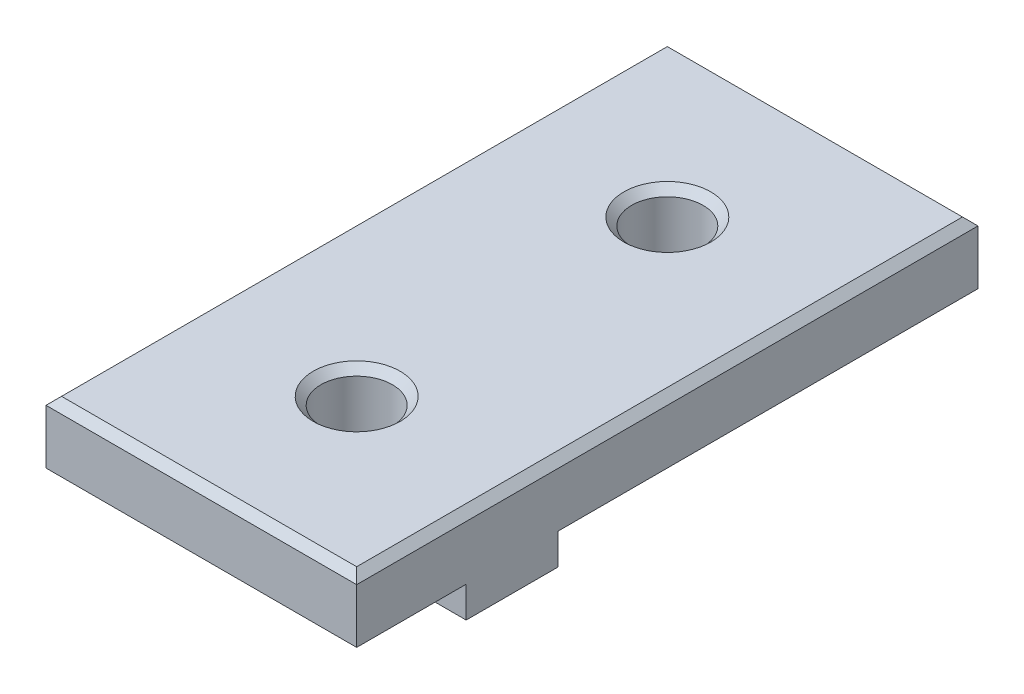
ISO-10303-21;
HEADER;
FILE_DESCRIPTION(('STEP AP214'),'2;1');
FILE_NAME('part.step','',(''),(''),'','','');
FILE_SCHEMA(('AUTOMOTIVE_DESIGN { 1 0 10303 214 1 1 1 1 }'));
ENDSEC;
DATA;
#1=APPLICATION_CONTEXT('core data for automotive mechanical design processes');
#2=APPLICATION_PROTOCOL_DEFINITION('international standard','automotive_design',2000,#1);
#3=PRODUCT_CONTEXT('',#1,'mechanical');
#4=PRODUCT('Part','Part','',(#3));
#5=PRODUCT_RELATED_PRODUCT_CATEGORY('part','',(#4));
#6=PRODUCT_DEFINITION_FORMATION('','',#4);
#7=PRODUCT_DEFINITION_CONTEXT('part definition',#1,'design');
#8=PRODUCT_DEFINITION('design','',#6,#7);
#9=PRODUCT_DEFINITION_SHAPE('','',#8);
#10=(LENGTH_UNIT() NAMED_UNIT(*) SI_UNIT(.MILLI.,.METRE.));
#11=(NAMED_UNIT(*) PLANE_ANGLE_UNIT() SI_UNIT($,.RADIAN.));
#12=(NAMED_UNIT(*) SI_UNIT($,.STERADIAN.) SOLID_ANGLE_UNIT());
#13=UNCERTAINTY_MEASURE_WITH_UNIT(LENGTH_MEASURE(1.E-05),#10,'distance_accuracy_value','');
#14=(GEOMETRIC_REPRESENTATION_CONTEXT(3) GLOBAL_UNCERTAINTY_ASSIGNED_CONTEXT((#13)) GLOBAL_UNIT_ASSIGNED_CONTEXT((#10,
#11,#12)) REPRESENTATION_CONTEXT('',''));
#15=CARTESIAN_POINT('',(0.,0.,0.));
#16=DIRECTION('',(0.,0.,1.));
#17=DIRECTION('',(1.,0.,0.));
#18=AXIS2_PLACEMENT_3D('',#15,#16,#17);
#19=CARTESIAN_POINT('',(0.,0.,0.));
#20=DIRECTION('',(0.,1.,0.));
#21=DIRECTION('',(0.,0.,1.));
#22=AXIS2_PLACEMENT_3D('',#19,#20,#21);
#23=PLANE('',#22);
#24=DIRECTION('',(0.,0.,1.));
#25=VECTOR('',#24,1.);
#26=CARTESIAN_POINT('',(2.95,0.,-7.));
#27=LINE('',#26,#25);
#28=CARTESIAN_POINT('',(2.95,0.,-7.));
#29=VERTEX_POINT('',#28);
#30=CARTESIAN_POINT('',(2.95,0.,-1.));
#31=VERTEX_POINT('',#30);
#32=EDGE_CURVE('E267',#29,#31,#27,.T.);
#33=ORIENTED_EDGE('',*,*,#32,.F.);
#34=DIRECTION('',(1.,0.,0.));
#35=VECTOR('',#34,1.);
#36=CARTESIAN_POINT('',(-2.95,0.,-7.));
#37=LINE('',#36,#35);
#38=CARTESIAN_POINT('',(-2.95,0.,-7.));
#39=VERTEX_POINT('',#38);
#40=EDGE_CURVE('E272',#39,#29,#37,.T.);
#41=ORIENTED_EDGE('',*,*,#40,.F.);
#42=DIRECTION('',(0.,0.,-1.));
#43=VECTOR('',#42,1.);
#44=CARTESIAN_POINT('',(-2.95,0.,-7.));
#45=LINE('',#44,#43);
#46=CARTESIAN_POINT('',(-2.95,0.,-1.));
#47=VERTEX_POINT('',#46);
#48=EDGE_CURVE('E284',#47,#39,#45,.T.);
#49=ORIENTED_EDGE('',*,*,#48,.F.);
#50=DIRECTION('',(-1.,0.,0.));
#51=VECTOR('',#50,1.);
#52=CARTESIAN_POINT('',(-2.95,0.,-1.));
#53=LINE('',#52,#51);
#54=EDGE_CURVE('E281',#31,#47,#53,.T.);
#55=ORIENTED_EDGE('',*,*,#54,.F.);
#56=EDGE_LOOP('',(#33,#41,#49,#55));
#57=FACE_BOUND('',#56,.T.);
#58=CARTESIAN_POINT('',(0.,0.,10.));
#59=DIRECTION('',(0.,1.,0.));
#60=DIRECTION('',(0.,0.,1.));
#61=AXIS2_PLACEMENT_3D('',#58,#59,#60);
#62=CIRCLE('',#61,2.3);
#63=CARTESIAN_POINT('',(0.,0.,12.3));
#64=VERTEX_POINT('',#63);
#65=EDGE_CURVE('E300',#64,#64,#62,.T.);
#66=ORIENTED_EDGE('',*,*,#65,.T.);
#67=EDGE_LOOP('',(#66));
#68=FACE_BOUND('',#67,.T.);
#69=CARTESIAN_POINT('',(0.,0.,-10.));
#70=DIRECTION('',(0.,1.,0.));
#71=DIRECTION('',(0.,0.,1.));
#72=AXIS2_PLACEMENT_3D('',#69,#70,#71);
#73=CIRCLE('',#72,2.3);
#74=CARTESIAN_POINT('',(0.,0.,-7.7));
#75=VERTEX_POINT('',#74);
#76=EDGE_CURVE('E303',#75,#75,#73,.T.);
#77=ORIENTED_EDGE('',*,*,#76,.T.);
#78=EDGE_LOOP('',(#77));
#79=FACE_BOUND('',#78,.T.);
#80=DIRECTION('',(-1.,0.,0.));
#81=VECTOR('',#80,1.);
#82=CARTESIAN_POINT('',(3.,0.,12.95));
#83=LINE('',#82,#81);
#84=CARTESIAN_POINT('',(9.99999999999999,0.,12.95));
#85=VERTEX_POINT('',#84);
#86=CARTESIAN_POINT('',(3.,0.,12.95));
#87=VERTEX_POINT('',#86);
#88=EDGE_CURVE('E361',#85,#87,#83,.T.);
#89=ORIENTED_EDGE('',*,*,#88,.F.);
#90=DIRECTION('',(0.,0.,-1.));
#91=VECTOR('',#90,1.);
#92=CARTESIAN_POINT('',(10.,0.,-20.));
#93=LINE('',#92,#91);
#94=CARTESIAN_POINT('',(10.,0.,20.));
#95=VERTEX_POINT('',#94);
#96=EDGE_CURVE('E209',#95,#85,#93,.T.);
#97=ORIENTED_EDGE('',*,*,#96,.F.);
#98=DIRECTION('',(1.,0.,0.));
#99=VECTOR('',#98,1.);
#100=CARTESIAN_POINT('',(-10.,0.,20.));
#101=LINE('',#100,#99);
#102=CARTESIAN_POINT('',(-10.,0.,20.));
#103=VERTEX_POINT('',#102);
#104=EDGE_CURVE('E316',#103,#95,#101,.T.);
#105=ORIENTED_EDGE('',*,*,#104,.F.);
#106=DIRECTION('',(0.,0.,1.));
#107=VECTOR('',#106,1.);
#108=CARTESIAN_POINT('',(-10.,0.,-20.));
#109=LINE('',#108,#107);
#110=CARTESIAN_POINT('',(-10.,0.,12.95));
#111=VERTEX_POINT('',#110);
#112=EDGE_CURVE('E312',#111,#103,#109,.T.);
#113=ORIENTED_EDGE('',*,*,#112,.F.);
#114=DIRECTION('',(-1.,0.,0.));
#115=VECTOR('',#114,1.);
#116=CARTESIAN_POINT('',(-10.,0.,12.95));
#117=LINE('',#116,#115);
#118=CARTESIAN_POINT('',(-3.,0.,12.95));
#119=VERTEX_POINT('',#118);
#120=EDGE_CURVE('E213',#119,#111,#117,.T.);
#121=ORIENTED_EDGE('',*,*,#120,.F.);
#122=DIRECTION('',(0.,0.,1.));
#123=VECTOR('',#122,1.);
#124=CARTESIAN_POINT('',(-3.,0.,12.95));
#125=LINE('',#124,#123);
#126=CARTESIAN_POINT('',(-3.,0.,7.05));
#127=VERTEX_POINT('',#126);
#128=EDGE_CURVE('E210',#127,#119,#125,.T.);
#129=ORIENTED_EDGE('',*,*,#128,.F.);
#130=DIRECTION('',(1.,0.,0.));
#131=VECTOR('',#130,1.);
#132=CARTESIAN_POINT('',(-10.,0.,7.05));
#133=LINE('',#132,#131);
#134=CARTESIAN_POINT('',(-10.,0.,7.05));
#135=VERTEX_POINT('',#134);
#136=EDGE_CURVE('E223',#135,#127,#133,.T.);
#137=ORIENTED_EDGE('',*,*,#136,.F.);
#138=CARTESIAN_POINT('',(-10.,0.,-20.));
#139=VERTEX_POINT('',#138);
#140=EDGE_CURVE('E313',#139,#135,#109,.T.);
#141=ORIENTED_EDGE('',*,*,#140,.F.);
#142=DIRECTION('',(-1.,0.,0.));
#143=VECTOR('',#142,1.);
#144=CARTESIAN_POINT('',(-10.,0.,-20.));
#145=LINE('',#144,#143);
#146=CARTESIAN_POINT('',(-2.95,0.,-20.));
#147=VERTEX_POINT('',#146);
#148=EDGE_CURVE('E308',#147,#139,#145,.T.);
#149=ORIENTED_EDGE('',*,*,#148,.F.);
#150=DIRECTION('',(0.,0.,-1.));
#151=VECTOR('',#150,1.);
#152=CARTESIAN_POINT('',(-2.95,0.,-13.));
#153=LINE('',#152,#151);
#154=CARTESIAN_POINT('',(-2.95,0.,-13.));
#155=VERTEX_POINT('',#154);
#156=EDGE_CURVE('E246',#155,#147,#153,.T.);
#157=ORIENTED_EDGE('',*,*,#156,.F.);
#158=DIRECTION('',(-1.,0.,0.));
#159=VECTOR('',#158,1.);
#160=CARTESIAN_POINT('',(-2.95,0.,-13.));
#161=LINE('',#160,#159);
#162=CARTESIAN_POINT('',(2.95,0.,-13.));
#163=VERTEX_POINT('',#162);
#164=EDGE_CURVE('E255',#163,#155,#161,.T.);
#165=ORIENTED_EDGE('',*,*,#164,.F.);
#166=DIRECTION('',(0.,0.,1.));
#167=VECTOR('',#166,1.);
#168=CARTESIAN_POINT('',(2.95,0.,-13.));
#169=LINE('',#168,#167);
#170=CARTESIAN_POINT('',(2.95,0.,-20.));
#171=VERTEX_POINT('',#170);
#172=EDGE_CURVE('E241',#171,#163,#169,.T.);
#173=ORIENTED_EDGE('',*,*,#172,.F.);
#174=CARTESIAN_POINT('',(10.,0.,-20.));
#175=VERTEX_POINT('',#174);
#176=EDGE_CURVE('E309',#175,#171,#145,.T.);
#177=ORIENTED_EDGE('',*,*,#176,.F.);
#178=CARTESIAN_POINT('',(10.,0.,7.05));
#179=VERTEX_POINT('',#178);
#180=EDGE_CURVE('E306',#179,#175,#93,.T.);
#181=ORIENTED_EDGE('',*,*,#180,.F.);
#182=DIRECTION('',(1.,0.,0.));
#183=VECTOR('',#182,1.);
#184=CARTESIAN_POINT('',(3.,0.,7.05));
#185=LINE('',#184,#183);
#186=CARTESIAN_POINT('',(3.,0.,7.05));
#187=VERTEX_POINT('',#186);
#188=EDGE_CURVE('E204',#187,#179,#185,.T.);
#189=ORIENTED_EDGE('',*,*,#188,.F.);
#190=DIRECTION('',(0.,0.,-1.));
#191=VECTOR('',#190,1.);
#192=CARTESIAN_POINT('',(3.,0.,12.95));
#193=LINE('',#192,#191);
#194=EDGE_CURVE('E365',#87,#187,#193,.T.);
#195=ORIENTED_EDGE('',*,*,#194,.F.);
#196=EDGE_LOOP('',(#89,#97,#105,#113,#121,#129,#137,#141,#149,#157,#165,#173,#177,#181,#189,#195));
#197=FACE_BOUND('',#196,.T.);
#198=ADVANCED_FACE('F34',(#57,#68,#79,#197),#23,.F.);
#199=CARTESIAN_POINT('',(10.,4.,-20.));
#200=DIRECTION('',(-1.,0.,0.));
#201=DIRECTION('',(0.,0.,1.));
#202=AXIS2_PLACEMENT_3D('',#199,#200,#201);
#203=PLANE('',#202);
#204=DIRECTION('',(0.,-1.,0.));
#205=VECTOR('',#204,1.);
#206=CARTESIAN_POINT('',(10.,4.,-20.));
#207=LINE('',#206,#205);
#208=CARTESIAN_POINT('',(10.,3.50000000000001,-20.));
#209=VERTEX_POINT('',#208);
#210=EDGE_CURVE('E325',#209,#175,#207,.T.);
#211=ORIENTED_EDGE('',*,*,#210,.F.);
#212=DIRECTION('',(0.,0.,1.));
#213=VECTOR('',#212,1.);
#214=CARTESIAN_POINT('',(10.,3.50000000000001,20.));
#215=LINE('',#214,#213);
#216=CARTESIAN_POINT('',(10.,3.50000000000001,20.));
#217=VERTEX_POINT('',#216);
#218=EDGE_CURVE('E347',#209,#217,#215,.T.);
#219=ORIENTED_EDGE('',*,*,#218,.T.);
#220=DIRECTION('',(0.,-1.,0.));
#221=VECTOR('',#220,1.);
#222=CARTESIAN_POINT('',(10.,4.,20.));
#223=LINE('',#222,#221);
#224=EDGE_CURVE('E319',#217,#95,#223,.T.);
#225=ORIENTED_EDGE('',*,*,#224,.T.);
#226=ORIENTED_EDGE('',*,*,#96,.T.);
#227=DIRECTION('',(0.,1.,0.));
#228=VECTOR('',#227,1.);
#229=CARTESIAN_POINT('',(9.99999999999999,-2.,12.95));
#230=LINE('',#229,#228);
#231=CARTESIAN_POINT('',(9.99999999999999,-2.,12.95));
#232=VERTEX_POINT('',#231);
#233=EDGE_CURVE('E189',#232,#85,#230,.T.);
#234=ORIENTED_EDGE('',*,*,#233,.F.);
#235=DIRECTION('',(0.,0.,1.));
#236=VECTOR('',#235,1.);
#237=CARTESIAN_POINT('',(9.99999999999999,-2.,12.95));
#238=LINE('',#237,#236);
#239=CARTESIAN_POINT('',(10.,-2.,7.05));
#240=VERTEX_POINT('',#239);
#241=EDGE_CURVE('E196',#240,#232,#238,.T.);
#242=ORIENTED_EDGE('',*,*,#241,.F.);
#243=DIRECTION('',(0.,1.,0.));
#244=VECTOR('',#243,1.);
#245=CARTESIAN_POINT('',(10.,-2.,7.05));
#246=LINE('',#245,#244);
#247=EDGE_CURVE('E373',#240,#179,#246,.T.);
#248=ORIENTED_EDGE('',*,*,#247,.T.);
#249=ORIENTED_EDGE('',*,*,#180,.T.);
#250=EDGE_LOOP('',(#211,#219,#225,#226,#234,#242,#248,#249));
#251=FACE_BOUND('',#250,.T.);
#252=ADVANCED_FACE('F207',(#251),#203,.F.);
#253=CARTESIAN_POINT('',(-10.,4.,-20.));
#254=DIRECTION('',(0.,0.,1.));
#255=DIRECTION('',(1.,0.,0.));
#256=AXIS2_PLACEMENT_3D('',#253,#254,#255);
#257=PLANE('',#256);
#258=DIRECTION('',(0.,-1.,0.));
#259=VECTOR('',#258,1.);
#260=CARTESIAN_POINT('',(-10.,4.,-20.));
#261=LINE('',#260,#259);
#262=CARTESIAN_POINT('',(-10.,3.50000000000001,-20.));
#263=VERTEX_POINT('',#262);
#264=EDGE_CURVE('E323',#263,#139,#261,.T.);
#265=ORIENTED_EDGE('',*,*,#264,.F.);
#266=DIRECTION('',(1.,0.,0.));
#267=VECTOR('',#266,1.);
#268=CARTESIAN_POINT('',(10.,3.50000000000001,-20.));
#269=LINE('',#268,#267);
#270=EDGE_CURVE('E51',#263,#209,#269,.T.);
#271=ORIENTED_EDGE('',*,*,#270,.T.);
#272=ORIENTED_EDGE('',*,*,#210,.T.);
#273=ORIENTED_EDGE('',*,*,#176,.T.);
#274=DIRECTION('',(0.,1.,0.));
#275=VECTOR('',#274,1.);
#276=CARTESIAN_POINT('',(2.95,-2.,-20.));
#277=LINE('',#276,#275);
#278=CARTESIAN_POINT('',(2.95,-2.,-20.));
#279=VERTEX_POINT('',#278);
#280=EDGE_CURVE('E252',#279,#171,#277,.T.);
#281=ORIENTED_EDGE('',*,*,#280,.F.);
#282=DIRECTION('',(1.,0.,0.));
#283=VECTOR('',#282,1.);
#284=CARTESIAN_POINT('',(-2.95,-2.,-20.));
#285=LINE('',#284,#283);
#286=CARTESIAN_POINT('',(-2.95,-2.,-20.));
#287=VERTEX_POINT('',#286);
#288=EDGE_CURVE('E250',#287,#279,#285,.T.);
#289=ORIENTED_EDGE('',*,*,#288,.F.);
#290=DIRECTION('',(0.,1.,0.));
#291=VECTOR('',#290,1.);
#292=CARTESIAN_POINT('',(-2.95,-2.,-20.));
#293=LINE('',#292,#291);
#294=EDGE_CURVE('E260',#287,#147,#293,.T.);
#295=ORIENTED_EDGE('',*,*,#294,.T.);
#296=ORIENTED_EDGE('',*,*,#148,.T.);
#297=EDGE_LOOP('',(#265,#271,#272,#273,#281,#289,#295,#296));
#298=FACE_BOUND('',#297,.T.);
#299=ADVANCED_FACE('F422',(#298),#257,.F.);
#300=CARTESIAN_POINT('',(-10.,4.,-20.));
#301=DIRECTION('',(1.,0.,0.));
#302=DIRECTION('',(0.,0.,-1.));
#303=AXIS2_PLACEMENT_3D('',#300,#301,#302);
#304=PLANE('',#303);
#305=DIRECTION('',(0.,-1.,0.));
#306=VECTOR('',#305,1.);
#307=CARTESIAN_POINT('',(-10.,4.,20.));
#308=LINE('',#307,#306);
#309=CARTESIAN_POINT('',(-10.,3.50000000000001,20.));
#310=VERTEX_POINT('',#309);
#311=EDGE_CURVE('E321',#310,#103,#308,.T.);
#312=ORIENTED_EDGE('',*,*,#311,.F.);
#313=DIRECTION('',(0.,0.,-1.));
#314=VECTOR('',#313,1.);
#315=CARTESIAN_POINT('',(-10.,3.50000000000001,-20.));
#316=LINE('',#315,#314);
#317=EDGE_CURVE('E59',#310,#263,#316,.T.);
#318=ORIENTED_EDGE('',*,*,#317,.T.);
#319=ORIENTED_EDGE('',*,*,#264,.T.);
#320=ORIENTED_EDGE('',*,*,#140,.T.);
#321=DIRECTION('',(0.,1.,0.));
#322=VECTOR('',#321,1.);
#323=CARTESIAN_POINT('',(-10.,-2.,7.05));
#324=LINE('',#323,#322);
#325=CARTESIAN_POINT('',(-10.,-2.,7.05));
#326=VERTEX_POINT('',#325);
#327=EDGE_CURVE('E235',#326,#135,#324,.T.);
#328=ORIENTED_EDGE('',*,*,#327,.F.);
#329=DIRECTION('',(0.,0.,-1.));
#330=VECTOR('',#329,1.);
#331=CARTESIAN_POINT('',(-10.,-2.,12.95));
#332=LINE('',#331,#330);
#333=CARTESIAN_POINT('',(-10.,-2.,12.95));
#334=VERTEX_POINT('',#333);
#335=EDGE_CURVE('E225',#334,#326,#332,.T.);
#336=ORIENTED_EDGE('',*,*,#335,.F.);
#337=DIRECTION('',(0.,1.,0.));
#338=VECTOR('',#337,1.);
#339=CARTESIAN_POINT('',(-10.,-2.,12.95));
#340=LINE('',#339,#338);
#341=EDGE_CURVE('E237',#334,#111,#340,.T.);
#342=ORIENTED_EDGE('',*,*,#341,.T.);
#343=ORIENTED_EDGE('',*,*,#112,.T.);
#344=EDGE_LOOP('',(#312,#318,#319,#320,#328,#336,#342,#343));
#345=FACE_BOUND('',#344,.T.);
#346=ADVANCED_FACE('F400',(#345),#304,.F.);
#347=CARTESIAN_POINT('',(-10.,4.,20.));
#348=DIRECTION('',(0.,0.,-1.));
#349=DIRECTION('',(-1.,0.,0.));
#350=AXIS2_PLACEMENT_3D('',#347,#348,#349);
#351=PLANE('',#350);
#352=ORIENTED_EDGE('',*,*,#224,.F.);
#353=DIRECTION('',(-1.,0.,0.));
#354=VECTOR('',#353,1.);
#355=CARTESIAN_POINT('',(-10.,3.50000000000001,20.));
#356=LINE('',#355,#354);
#357=EDGE_CURVE('E342',#217,#310,#356,.T.);
#358=ORIENTED_EDGE('',*,*,#357,.T.);
#359=ORIENTED_EDGE('',*,*,#311,.T.);
#360=ORIENTED_EDGE('',*,*,#104,.T.);
#361=EDGE_LOOP('',(#352,#358,#359,#360));
#362=FACE_BOUND('',#361,.T.);
#363=ADVANCED_FACE('F398',(#362),#351,.F.);
#364=CARTESIAN_POINT('',(0.,4.,0.));
#365=DIRECTION('',(0.,1.,0.));
#366=DIRECTION('',(0.,0.,1.));
#367=AXIS2_PLACEMENT_3D('',#364,#365,#366);
#368=PLANE('',#367);
#369=DIRECTION('',(0.,0.,1.));
#370=VECTOR('',#369,1.);
#371=CARTESIAN_POINT('',(-9.5,4.,20.));
#372=LINE('',#371,#370);
#373=CARTESIAN_POINT('',(-9.50000000000001,4.,-19.5));
#374=VERTEX_POINT('',#373);
#375=CARTESIAN_POINT('',(-9.5,4.,19.5));
#376=VERTEX_POINT('',#375);
#377=EDGE_CURVE('E337',#374,#376,#372,.T.);
#378=ORIENTED_EDGE('',*,*,#377,.T.);
#379=DIRECTION('',(1.,0.,0.));
#380=VECTOR('',#379,1.);
#381=CARTESIAN_POINT('',(10.,4.,19.5));
#382=LINE('',#381,#380);
#383=CARTESIAN_POINT('',(9.50000000000001,4.,19.5));
#384=VERTEX_POINT('',#383);
#385=EDGE_CURVE('E339',#376,#384,#382,.T.);
#386=ORIENTED_EDGE('',*,*,#385,.T.);
#387=DIRECTION('',(0.,0.,-1.));
#388=VECTOR('',#387,1.);
#389=CARTESIAN_POINT('',(9.50000000000001,4.,-20.));
#390=LINE('',#389,#388);
#391=CARTESIAN_POINT('',(9.50000000000001,4.,-19.5));
#392=VERTEX_POINT('',#391);
#393=EDGE_CURVE('E333',#384,#392,#390,.T.);
#394=ORIENTED_EDGE('',*,*,#393,.T.);
#395=DIRECTION('',(-1.,0.,0.));
#396=VECTOR('',#395,1.);
#397=CARTESIAN_POINT('',(-10.,4.,-19.5));
#398=LINE('',#397,#396);
#399=EDGE_CURVE('E335',#392,#374,#398,.T.);
#400=ORIENTED_EDGE('',*,*,#399,.T.);
#401=EDGE_LOOP('',(#378,#386,#394,#400));
#402=FACE_BOUND('',#401,.T.);
#403=CARTESIAN_POINT('',(0.,4.,-10.));
#404=DIRECTION('',(0.,1.,0.));
#405=DIRECTION('',(0.,0.,1.));
#406=AXIS2_PLACEMENT_3D('',#403,#404,#405);
#407=CIRCLE('',#406,2.8);
#408=CARTESIAN_POINT('',(0.,4.,-7.20000000000001));
#409=VERTEX_POINT('',#408);
#410=EDGE_CURVE('E330',#409,#409,#407,.F.);
#411=ORIENTED_EDGE('',*,*,#410,.T.);
#412=EDGE_LOOP('',(#411));
#413=FACE_BOUND('',#412,.T.);
#414=CARTESIAN_POINT('',(0.,4.,10.));
#415=DIRECTION('',(0.,1.,0.));
#416=DIRECTION('',(0.,0.,1.));
#417=AXIS2_PLACEMENT_3D('',#414,#415,#416);
#418=CIRCLE('',#417,2.79999999999999);
#419=CARTESIAN_POINT('',(0.,4.,12.8));
#420=VERTEX_POINT('',#419);
#421=EDGE_CURVE('E327',#420,#420,#418,.F.);
#422=ORIENTED_EDGE('',*,*,#421,.T.);
#423=EDGE_LOOP('',(#422));
#424=FACE_BOUND('',#423,.T.);
#425=ADVANCED_FACE('F458',(#402,#413,#424),#368,.T.);
#426=CARTESIAN_POINT('',(0.,0.,-10.));
#427=DIRECTION('',(0.,1.,0.));
#428=DIRECTION('',(0.,0.,1.));
#429=AXIS2_PLACEMENT_3D('',#426,#427,#428);
#430=CYLINDRICAL_SURFACE('',#429,2.3);
#431=CARTESIAN_POINT('',(0.,3.5,-10.));
#432=DIRECTION('',(0.,1.,0.));
#433=DIRECTION('',(0.,0.,1.));
#434=AXIS2_PLACEMENT_3D('',#431,#432,#433);
#435=CIRCLE('',#434,2.3);
#436=CARTESIAN_POINT('',(0.,3.5,-7.7));
#437=VERTEX_POINT('',#436);
#438=EDGE_CURVE('E43',#437,#437,#435,.T.);
#439=ORIENTED_EDGE('',*,*,#438,.T.);
#440=EDGE_LOOP('',(#439));
#441=FACE_BOUND('',#440,.T.);
#442=ORIENTED_EDGE('',*,*,#76,.F.);
#443=EDGE_LOOP('',(#442));
#444=FACE_BOUND('',#443,.T.);
#445=ADVANCED_FACE('F485',(#441,#444),#430,.F.);
#446=CARTESIAN_POINT('',(0.,0.,10.));
#447=DIRECTION('',(0.,1.,0.));
#448=DIRECTION('',(0.,0.,1.));
#449=AXIS2_PLACEMENT_3D('',#446,#447,#448);
#450=CYLINDRICAL_SURFACE('',#449,2.3);
#451=CARTESIAN_POINT('',(0.,3.50000000000001,10.));
#452=DIRECTION('',(0.,1.,0.));
#453=DIRECTION('',(0.,0.,1.));
#454=AXIS2_PLACEMENT_3D('',#451,#452,#453);
#455=CIRCLE('',#454,2.3);
#456=CARTESIAN_POINT('',(0.,3.50000000000001,12.3));
#457=VERTEX_POINT('',#456);
#458=EDGE_CURVE('E11',#457,#457,#455,.T.);
#459=ORIENTED_EDGE('',*,*,#458,.T.);
#460=EDGE_LOOP('',(#459));
#461=FACE_BOUND('',#460,.T.);
#462=ORIENTED_EDGE('',*,*,#65,.F.);
#463=EDGE_LOOP('',(#462));
#464=FACE_BOUND('',#463,.T.);
#465=ADVANCED_FACE('F488',(#461,#464),#450,.F.);
#466=CARTESIAN_POINT('',(2.95,-2.,-7.));
#467=DIRECTION('',(-1.,0.,0.));
#468=DIRECTION('',(0.,0.,1.));
#469=AXIS2_PLACEMENT_3D('',#466,#467,#468);
#470=PLANE('',#469);
#471=ORIENTED_EDGE('',*,*,#32,.T.);
#472=DIRECTION('',(0.,1.,0.));
#473=VECTOR('',#472,1.);
#474=CARTESIAN_POINT('',(2.95,-2.,-1.));
#475=LINE('',#474,#473);
#476=CARTESIAN_POINT('',(2.95,-2.,-1.));
#477=VERTEX_POINT('',#476);
#478=EDGE_CURVE('E297',#477,#31,#475,.T.);
#479=ORIENTED_EDGE('',*,*,#478,.F.);
#480=DIRECTION('',(0.,0.,1.));
#481=VECTOR('',#480,1.);
#482=CARTESIAN_POINT('',(2.95,-2.,-7.));
#483=LINE('',#482,#481);
#484=CARTESIAN_POINT('',(2.95,-2.,-7.));
#485=VERTEX_POINT('',#484);
#486=EDGE_CURVE('E268',#485,#477,#483,.T.);
#487=ORIENTED_EDGE('',*,*,#486,.F.);
#488=DIRECTION('',(0.,1.,0.));
#489=VECTOR('',#488,1.);
#490=CARTESIAN_POINT('',(2.95,-2.,-7.));
#491=LINE('',#490,#489);
#492=EDGE_CURVE('E278',#485,#29,#491,.T.);
#493=ORIENTED_EDGE('',*,*,#492,.T.);
#494=EDGE_LOOP('',(#471,#479,#487,#493));
#495=FACE_BOUND('',#494,.T.);
#496=ADVANCED_FACE('F495',(#495),#470,.F.);
#497=CARTESIAN_POINT('',(-2.95,-2.,-1.));
#498=DIRECTION('',(0.,0.,-1.));
#499=DIRECTION('',(-1.,0.,0.));
#500=AXIS2_PLACEMENT_3D('',#497,#498,#499);
#501=PLANE('',#500);
#502=ORIENTED_EDGE('',*,*,#54,.T.);
#503=DIRECTION('',(0.,1.,0.));
#504=VECTOR('',#503,1.);
#505=CARTESIAN_POINT('',(-2.95,-2.,-1.));
#506=LINE('',#505,#504);
#507=CARTESIAN_POINT('',(-2.95,-2.,-1.));
#508=VERTEX_POINT('',#507);
#509=EDGE_CURVE('E294',#508,#47,#506,.T.);
#510=ORIENTED_EDGE('',*,*,#509,.F.);
#511=DIRECTION('',(-1.,0.,0.));
#512=VECTOR('',#511,1.);
#513=CARTESIAN_POINT('',(-2.95,-2.,-1.));
#514=LINE('',#513,#512);
#515=EDGE_CURVE('E271',#477,#508,#514,.T.);
#516=ORIENTED_EDGE('',*,*,#515,.F.);
#517=ORIENTED_EDGE('',*,*,#478,.T.);
#518=EDGE_LOOP('',(#502,#510,#516,#517));
#519=FACE_BOUND('',#518,.T.);
#520=ADVANCED_FACE('F502',(#519),#501,.F.);
#521=CARTESIAN_POINT('',(-2.95,-2.,-7.));
#522=DIRECTION('',(1.,0.,0.));
#523=DIRECTION('',(0.,0.,-1.));
#524=AXIS2_PLACEMENT_3D('',#521,#522,#523);
#525=PLANE('',#524);
#526=ORIENTED_EDGE('',*,*,#48,.T.);
#527=DIRECTION('',(0.,1.,0.));
#528=VECTOR('',#527,1.);
#529=CARTESIAN_POINT('',(-2.95,-2.,-7.));
#530=LINE('',#529,#528);
#531=CARTESIAN_POINT('',(-2.95,-2.,-7.));
#532=VERTEX_POINT('',#531);
#533=EDGE_CURVE('E291',#532,#39,#530,.T.);
#534=ORIENTED_EDGE('',*,*,#533,.F.);
#535=DIRECTION('',(0.,0.,-1.));
#536=VECTOR('',#535,1.);
#537=CARTESIAN_POINT('',(-2.95,-2.,-7.));
#538=LINE('',#537,#536);
#539=EDGE_CURVE('E274',#508,#532,#538,.T.);
#540=ORIENTED_EDGE('',*,*,#539,.F.);
#541=ORIENTED_EDGE('',*,*,#509,.T.);
#542=EDGE_LOOP('',(#526,#534,#540,#541));
#543=FACE_BOUND('',#542,.T.);
#544=ADVANCED_FACE('F506',(#543),#525,.F.);
#545=CARTESIAN_POINT('',(-2.95,-2.,-7.));
#546=DIRECTION('',(0.,0.,1.));
#547=DIRECTION('',(1.,0.,0.));
#548=AXIS2_PLACEMENT_3D('',#545,#546,#547);
#549=PLANE('',#548);
#550=ORIENTED_EDGE('',*,*,#40,.T.);
#551=ORIENTED_EDGE('',*,*,#492,.F.);
#552=DIRECTION('',(1.,0.,0.));
#553=VECTOR('',#552,1.);
#554=CARTESIAN_POINT('',(-2.95,-2.,-7.));
#555=LINE('',#554,#553);
#556=EDGE_CURVE('E276',#532,#485,#555,.T.);
#557=ORIENTED_EDGE('',*,*,#556,.F.);
#558=ORIENTED_EDGE('',*,*,#533,.T.);
#559=EDGE_LOOP('',(#550,#551,#557,#558));
#560=FACE_BOUND('',#559,.T.);
#561=ADVANCED_FACE('F510',(#560),#549,.F.);
#562=CARTESIAN_POINT('',(0.,-2.,0.));
#563=DIRECTION('',(0.,1.,0.));
#564=DIRECTION('',(0.,0.,1.));
#565=AXIS2_PLACEMENT_3D('',#562,#563,#564);
#566=PLANE('',#565);
#567=ORIENTED_EDGE('',*,*,#486,.T.);
#568=ORIENTED_EDGE('',*,*,#515,.T.);
#569=ORIENTED_EDGE('',*,*,#539,.T.);
#570=ORIENTED_EDGE('',*,*,#556,.T.);
#571=EDGE_LOOP('',(#567,#568,#569,#570));
#572=FACE_BOUND('',#571,.T.);
#573=ADVANCED_FACE('F514',(#572),#566,.F.);
#574=CARTESIAN_POINT('',(2.95,-2.,-13.));
#575=DIRECTION('',(-1.,0.,0.));
#576=DIRECTION('',(0.,0.,1.));
#577=AXIS2_PLACEMENT_3D('',#574,#575,#576);
#578=PLANE('',#577);
#579=ORIENTED_EDGE('',*,*,#172,.T.);
#580=DIRECTION('',(0.,1.,0.));
#581=VECTOR('',#580,1.);
#582=CARTESIAN_POINT('',(2.95,-2.,-13.));
#583=LINE('',#582,#581);
#584=CARTESIAN_POINT('',(2.95,-2.,-13.));
#585=VERTEX_POINT('',#584);
#586=EDGE_CURVE('E265',#585,#163,#583,.T.);
#587=ORIENTED_EDGE('',*,*,#586,.F.);
#588=DIRECTION('',(0.,0.,1.));
#589=VECTOR('',#588,1.);
#590=CARTESIAN_POINT('',(2.95,-2.,-13.));
#591=LINE('',#590,#589);
#592=EDGE_CURVE('E242',#279,#585,#591,.T.);
#593=ORIENTED_EDGE('',*,*,#592,.F.);
#594=ORIENTED_EDGE('',*,*,#280,.T.);
#595=EDGE_LOOP('',(#579,#587,#593,#594));
#596=FACE_BOUND('',#595,.T.);
#597=ADVANCED_FACE('F436',(#596),#578,.F.);
#598=CARTESIAN_POINT('',(-2.95,-2.,-13.));
#599=DIRECTION('',(0.,0.,-1.));
#600=DIRECTION('',(-1.,0.,0.));
#601=AXIS2_PLACEMENT_3D('',#598,#599,#600);
#602=PLANE('',#601);
#603=ORIENTED_EDGE('',*,*,#164,.T.);
#604=DIRECTION('',(0.,1.,0.));
#605=VECTOR('',#604,1.);
#606=CARTESIAN_POINT('',(-2.95,-2.,-13.));
#607=LINE('',#606,#605);
#608=CARTESIAN_POINT('',(-2.95,-2.,-13.));
#609=VERTEX_POINT('',#608);
#610=EDGE_CURVE('E262',#609,#155,#607,.T.);
#611=ORIENTED_EDGE('',*,*,#610,.F.);
#612=DIRECTION('',(-1.,0.,0.));
#613=VECTOR('',#612,1.);
#614=CARTESIAN_POINT('',(-2.95,-2.,-13.));
#615=LINE('',#614,#613);
#616=EDGE_CURVE('E245',#585,#609,#615,.T.);
#617=ORIENTED_EDGE('',*,*,#616,.F.);
#618=ORIENTED_EDGE('',*,*,#586,.T.);
#619=EDGE_LOOP('',(#603,#611,#617,#618));
#620=FACE_BOUND('',#619,.T.);
#621=ADVANCED_FACE('F432',(#620),#602,.F.);
#622=CARTESIAN_POINT('',(-2.95,-2.,-13.));
#623=DIRECTION('',(1.,0.,0.));
#624=DIRECTION('',(0.,0.,-1.));
#625=AXIS2_PLACEMENT_3D('',#622,#623,#624);
#626=PLANE('',#625);
#627=ORIENTED_EDGE('',*,*,#156,.T.);
#628=ORIENTED_EDGE('',*,*,#294,.F.);
#629=DIRECTION('',(0.,0.,-1.));
#630=VECTOR('',#629,1.);
#631=CARTESIAN_POINT('',(-2.95,-2.,-13.));
#632=LINE('',#631,#630);
#633=EDGE_CURVE('E248',#609,#287,#632,.T.);
#634=ORIENTED_EDGE('',*,*,#633,.F.);
#635=ORIENTED_EDGE('',*,*,#610,.T.);
#636=EDGE_LOOP('',(#627,#628,#634,#635));
#637=FACE_BOUND('',#636,.T.);
#638=ADVANCED_FACE('F428',(#637),#626,.F.);
#639=CARTESIAN_POINT('',(0.,-2.,0.));
#640=DIRECTION('',(0.,-1.,0.));
#641=DIRECTION('',(0.,0.,-1.));
#642=AXIS2_PLACEMENT_3D('',#639,#640,#641);
#643=PLANE('',#642);
#644=ORIENTED_EDGE('',*,*,#592,.T.);
#645=ORIENTED_EDGE('',*,*,#616,.T.);
#646=ORIENTED_EDGE('',*,*,#633,.T.);
#647=ORIENTED_EDGE('',*,*,#288,.T.);
#648=EDGE_LOOP('',(#644,#645,#646,#647));
#649=FACE_BOUND('',#648,.T.);
#650=ADVANCED_FACE('F439',(#649),#643,.T.);
#651=CARTESIAN_POINT('',(-3.,-2.,12.95));
#652=DIRECTION('',(-1.,0.,0.));
#653=DIRECTION('',(0.,0.,1.));
#654=AXIS2_PLACEMENT_3D('',#651,#652,#653);
#655=PLANE('',#654);
#656=ORIENTED_EDGE('',*,*,#128,.T.);
#657=DIRECTION('',(0.,1.,0.));
#658=VECTOR('',#657,1.);
#659=CARTESIAN_POINT('',(-3.,-2.,12.95));
#660=LINE('',#659,#658);
#661=CARTESIAN_POINT('',(-3.,-2.,12.95));
#662=VERTEX_POINT('',#661);
#663=EDGE_CURVE('E239',#662,#119,#660,.T.);
#664=ORIENTED_EDGE('',*,*,#663,.F.);
#665=DIRECTION('',(0.,0.,1.));
#666=VECTOR('',#665,1.);
#667=CARTESIAN_POINT('',(-3.,-2.,12.95));
#668=LINE('',#667,#666);
#669=CARTESIAN_POINT('',(-3.,-2.,7.05));
#670=VERTEX_POINT('',#669);
#671=EDGE_CURVE('E219',#670,#662,#668,.T.);
#672=ORIENTED_EDGE('',*,*,#671,.F.);
#673=DIRECTION('',(0.,1.,0.));
#674=VECTOR('',#673,1.);
#675=CARTESIAN_POINT('',(-3.,-2.,7.05));
#676=LINE('',#675,#674);
#677=EDGE_CURVE('E228',#670,#127,#676,.T.);
#678=ORIENTED_EDGE('',*,*,#677,.T.);
#679=EDGE_LOOP('',(#656,#664,#672,#678));
#680=FACE_BOUND('',#679,.T.);
#681=ADVANCED_FACE('F413',(#680),#655,.F.);
#682=CARTESIAN_POINT('',(-10.,-2.,12.95));
#683=DIRECTION('',(0.,0.,-1.));
#684=DIRECTION('',(-1.,0.,0.));
#685=AXIS2_PLACEMENT_3D('',#682,#683,#684);
#686=PLANE('',#685);
#687=ORIENTED_EDGE('',*,*,#120,.T.);
#688=ORIENTED_EDGE('',*,*,#341,.F.);
#689=DIRECTION('',(-1.,0.,0.));
#690=VECTOR('',#689,1.);
#691=CARTESIAN_POINT('',(-10.,-2.,12.95));
#692=LINE('',#691,#690);
#693=EDGE_CURVE('E222',#662,#334,#692,.T.);
#694=ORIENTED_EDGE('',*,*,#693,.F.);
#695=ORIENTED_EDGE('',*,*,#663,.T.);
#696=EDGE_LOOP('',(#687,#688,#694,#695));
#697=FACE_BOUND('',#696,.T.);
#698=ADVANCED_FACE('F409',(#697),#686,.F.);
#699=CARTESIAN_POINT('',(-10.,-2.,7.05));
#700=DIRECTION('',(0.,0.,1.));
#701=DIRECTION('',(1.,0.,0.));
#702=AXIS2_PLACEMENT_3D('',#699,#700,#701);
#703=PLANE('',#702);
#704=ORIENTED_EDGE('',*,*,#136,.T.);
#705=ORIENTED_EDGE('',*,*,#677,.F.);
#706=DIRECTION('',(1.,0.,0.));
#707=VECTOR('',#706,1.);
#708=CARTESIAN_POINT('',(-10.,-2.,7.05));
#709=LINE('',#708,#707);
#710=EDGE_CURVE('E227',#326,#670,#709,.T.);
#711=ORIENTED_EDGE('',*,*,#710,.F.);
#712=ORIENTED_EDGE('',*,*,#327,.T.);
#713=EDGE_LOOP('',(#704,#705,#711,#712));
#714=FACE_BOUND('',#713,.T.);
#715=ADVANCED_FACE('F417',(#714),#703,.F.);
#716=CARTESIAN_POINT('',(0.,-2.,0.));
#717=DIRECTION('',(0.,-1.,0.));
#718=DIRECTION('',(0.,0.,-1.));
#719=AXIS2_PLACEMENT_3D('',#716,#717,#718);
#720=PLANE('',#719);
#721=ORIENTED_EDGE('',*,*,#671,.T.);
#722=ORIENTED_EDGE('',*,*,#693,.T.);
#723=ORIENTED_EDGE('',*,*,#335,.T.);
#724=ORIENTED_EDGE('',*,*,#710,.T.);
#725=EDGE_LOOP('',(#721,#722,#723,#724));
#726=FACE_BOUND('',#725,.T.);
#727=ADVANCED_FACE('F557',(#726),#720,.T.);
#728=CARTESIAN_POINT('',(3.,-2.,12.95));
#729=DIRECTION('',(0.,0.,-1.));
#730=DIRECTION('',(-1.,0.,0.));
#731=AXIS2_PLACEMENT_3D('',#728,#729,#730);
#732=PLANE('',#731);
#733=ORIENTED_EDGE('',*,*,#88,.T.);
#734=DIRECTION('',(0.,1.,0.));
#735=VECTOR('',#734,1.);
#736=CARTESIAN_POINT('',(3.,-2.,12.95));
#737=LINE('',#736,#735);
#738=CARTESIAN_POINT('',(3.,-2.,12.95));
#739=VERTEX_POINT('',#738);
#740=EDGE_CURVE('E192',#739,#87,#737,.T.);
#741=ORIENTED_EDGE('',*,*,#740,.F.);
#742=DIRECTION('',(-1.,0.,0.));
#743=VECTOR('',#742,1.);
#744=CARTESIAN_POINT('',(3.,-2.,12.95));
#745=LINE('',#744,#743);
#746=EDGE_CURVE('E185',#232,#739,#745,.T.);
#747=ORIENTED_EDGE('',*,*,#746,.F.);
#748=ORIENTED_EDGE('',*,*,#233,.T.);
#749=EDGE_LOOP('',(#733,#741,#747,#748));
#750=FACE_BOUND('',#749,.T.);
#751=ADVANCED_FACE('F187',(#750),#732,.F.);
#752=CARTESIAN_POINT('',(3.,-2.,12.95));
#753=DIRECTION('',(1.,0.,0.));
#754=DIRECTION('',(0.,0.,-1.));
#755=AXIS2_PLACEMENT_3D('',#752,#753,#754);
#756=PLANE('',#755);
#757=ORIENTED_EDGE('',*,*,#194,.T.);
#758=DIRECTION('',(0.,1.,0.));
#759=VECTOR('',#758,1.);
#760=CARTESIAN_POINT('',(3.,-2.,7.05));
#761=LINE('',#760,#759);
#762=CARTESIAN_POINT('',(3.,-2.,7.05));
#763=VERTEX_POINT('',#762);
#764=EDGE_CURVE('E215',#763,#187,#761,.T.);
#765=ORIENTED_EDGE('',*,*,#764,.F.);
#766=DIRECTION('',(0.,0.,-1.));
#767=VECTOR('',#766,1.);
#768=CARTESIAN_POINT('',(3.,-2.,12.95));
#769=LINE('',#768,#767);
#770=EDGE_CURVE('E195',#739,#763,#769,.T.);
#771=ORIENTED_EDGE('',*,*,#770,.F.);
#772=ORIENTED_EDGE('',*,*,#740,.T.);
#773=EDGE_LOOP('',(#757,#765,#771,#772));
#774=FACE_BOUND('',#773,.T.);
#775=ADVANCED_FACE('F575',(#774),#756,.F.);
#776=CARTESIAN_POINT('',(3.,-2.,7.05));
#777=DIRECTION('',(0.,0.,1.));
#778=DIRECTION('',(1.,0.,0.));
#779=AXIS2_PLACEMENT_3D('',#776,#777,#778);
#780=PLANE('',#779);
#781=ORIENTED_EDGE('',*,*,#188,.T.);
#782=ORIENTED_EDGE('',*,*,#247,.F.);
#783=DIRECTION('',(1.,0.,0.));
#784=VECTOR('',#783,1.);
#785=CARTESIAN_POINT('',(3.,-2.,7.05));
#786=LINE('',#785,#784);
#787=EDGE_CURVE('E201',#763,#240,#786,.T.);
#788=ORIENTED_EDGE('',*,*,#787,.F.);
#789=ORIENTED_EDGE('',*,*,#764,.T.);
#790=EDGE_LOOP('',(#781,#782,#788,#789));
#791=FACE_BOUND('',#790,.T.);
#792=ADVANCED_FACE('F378',(#791),#780,.F.);
#793=CARTESIAN_POINT('',(0.,-2.,0.));
#794=DIRECTION('',(0.,-1.,0.));
#795=DIRECTION('',(0.,0.,-1.));
#796=AXIS2_PLACEMENT_3D('',#793,#794,#795);
#797=PLANE('',#796);
#798=ORIENTED_EDGE('',*,*,#241,.T.);
#799=ORIENTED_EDGE('',*,*,#746,.T.);
#800=ORIENTED_EDGE('',*,*,#770,.T.);
#801=ORIENTED_EDGE('',*,*,#787,.T.);
#802=EDGE_LOOP('',(#798,#799,#800,#801));
#803=FACE_BOUND('',#802,.T.);
#804=ADVANCED_FACE('F199',(#803),#797,.T.);
#805=CARTESIAN_POINT('',(0.,4.,-19.5));
#806=DIRECTION('',(0.,0.707106781186547,-0.707106781186547));
#807=DIRECTION('',(1.,0.,0.));
#808=AXIS2_PLACEMENT_3D('',#805,#806,#807);
#809=PLANE('',#808);
#810=DIRECTION('',(-0.577350269189625,0.577350269189626,0.577350269189626));
#811=VECTOR('',#810,1.);
#812=CARTESIAN_POINT('',(3.00000000000001,10.5,-13.));
#813=LINE('',#812,#811);
#814=EDGE_CURVE('E354',#209,#392,#813,.T.);
#815=ORIENTED_EDGE('',*,*,#814,.F.);
#816=ORIENTED_EDGE('',*,*,#270,.F.);
#817=DIRECTION('',(0.577350269189627,0.577350269189625,0.577350269189625));
#818=VECTOR('',#817,1.);
#819=CARTESIAN_POINT('',(-6.33333333333333,7.16666666666667,-16.3333333333333));
#820=LINE('',#819,#818);
#821=EDGE_CURVE('E38',#374,#263,#820,.F.);
#822=ORIENTED_EDGE('',*,*,#821,.F.);
#823=ORIENTED_EDGE('',*,*,#399,.F.);
#824=EDGE_LOOP('',(#815,#816,#822,#823));
#825=FACE_BOUND('',#824,.T.);
#826=ADVANCED_FACE('F389',(#825),#809,.T.);
#827=CARTESIAN_POINT('',(-9.50000000000001,4.,0.));
#828=DIRECTION('',(-0.707106781186547,0.707106781186548,0.));
#829=DIRECTION('',(0.,0.,-1.));
#830=AXIS2_PLACEMENT_3D('',#827,#828,#829);
#831=PLANE('',#830);
#832=ORIENTED_EDGE('',*,*,#821,.T.);
#833=ORIENTED_EDGE('',*,*,#317,.F.);
#834=DIRECTION('',(0.577350269189626,0.577350269189626,-0.577350269189625));
#835=VECTOR('',#834,1.);
#836=CARTESIAN_POINT('',(-3.,10.5,13.));
#837=LINE('',#836,#835);
#838=EDGE_CURVE('E353',#376,#310,#837,.F.);
#839=ORIENTED_EDGE('',*,*,#838,.F.);
#840=ORIENTED_EDGE('',*,*,#377,.F.);
#841=EDGE_LOOP('',(#832,#833,#839,#840));
#842=FACE_BOUND('',#841,.T.);
#843=ADVANCED_FACE('F471',(#842),#831,.T.);
#844=CARTESIAN_POINT('',(9.50000000000001,4.,0.));
#845=DIRECTION('',(0.707106781186548,0.707106781186547,0.));
#846=DIRECTION('',(0.,0.,1.));
#847=AXIS2_PLACEMENT_3D('',#844,#845,#846);
#848=PLANE('',#847);
#849=ORIENTED_EDGE('',*,*,#814,.T.);
#850=ORIENTED_EDGE('',*,*,#393,.F.);
#851=DIRECTION('',(0.577350269189625,-0.577350269189626,0.577350269189626));
#852=VECTOR('',#851,1.);
#853=CARTESIAN_POINT('',(3.00000000000001,10.5,13.));
#854=LINE('',#853,#852);
#855=EDGE_CURVE('E351',#217,#384,#854,.F.);
#856=ORIENTED_EDGE('',*,*,#855,.F.);
#857=ORIENTED_EDGE('',*,*,#218,.F.);
#858=EDGE_LOOP('',(#849,#850,#856,#857));
#859=FACE_BOUND('',#858,.T.);
#860=ADVANCED_FACE('F391',(#859),#848,.T.);
#861=CARTESIAN_POINT('',(0.,4.,19.5));
#862=DIRECTION('',(0.,0.707106781186547,0.707106781186547));
#863=DIRECTION('',(-1.,0.,0.));
#864=AXIS2_PLACEMENT_3D('',#861,#862,#863);
#865=PLANE('',#864);
#866=ORIENTED_EDGE('',*,*,#838,.T.);
#867=ORIENTED_EDGE('',*,*,#357,.F.);
#868=ORIENTED_EDGE('',*,*,#855,.T.);
#869=ORIENTED_EDGE('',*,*,#385,.F.);
#870=EDGE_LOOP('',(#866,#867,#868,#869));
#871=FACE_BOUND('',#870,.T.);
#872=ADVANCED_FACE('F395',(#871),#865,.T.);
#873=CARTESIAN_POINT('',(0.,3.5,-10.));
#874=DIRECTION('',(0.,1.,0.));
#875=DIRECTION('',(0.,0.,1.));
#876=AXIS2_PLACEMENT_3D('',#873,#874,#875);
#877=CONICAL_SURFACE('',#876,2.3,0.785398163397447);
#878=ORIENTED_EDGE('',*,*,#410,.F.);
#879=EDGE_LOOP('',(#878));
#880=FACE_BOUND('',#879,.T.);
#881=ORIENTED_EDGE('',*,*,#438,.F.);
#882=EDGE_LOOP('',(#881));
#883=FACE_BOUND('',#882,.T.);
#884=ADVANCED_FACE('F468',(#880,#883),#877,.F.);
#885=CARTESIAN_POINT('',(0.,3.50000000000001,10.));
#886=DIRECTION('',(0.,1.,0.));
#887=DIRECTION('',(0.,0.,1.));
#888=AXIS2_PLACEMENT_3D('',#885,#886,#887);
#889=CONICAL_SURFACE('',#888,2.3,0.785398163397447);
#890=ORIENTED_EDGE('',*,*,#421,.F.);
#891=EDGE_LOOP('',(#890));
#892=FACE_BOUND('',#891,.T.);
#893=ORIENTED_EDGE('',*,*,#458,.F.);
#894=EDGE_LOOP('',(#893));
#895=FACE_BOUND('',#894,.T.);
#896=ADVANCED_FACE('F36',(#892,#895),#889,.F.);
#897=CLOSED_SHELL('',(#198,#252,#299,#346,#363,#425,#445,#465,#496,#520,#544,#561,#573,#597,
#621,#638,#650,#681,#698,#715,#727,#751,#775,#792,#804,#826,#843,#860,#872,#884,#896));
#898=MANIFOLD_SOLID_BREP('B2',#897);
#899=ADVANCED_BREP_SHAPE_REPRESENTATION('',(#18,#898),#14);
#900=SHAPE_DEFINITION_REPRESENTATION(#9,#899);
ENDSEC;
END-ISO-10303-21;
